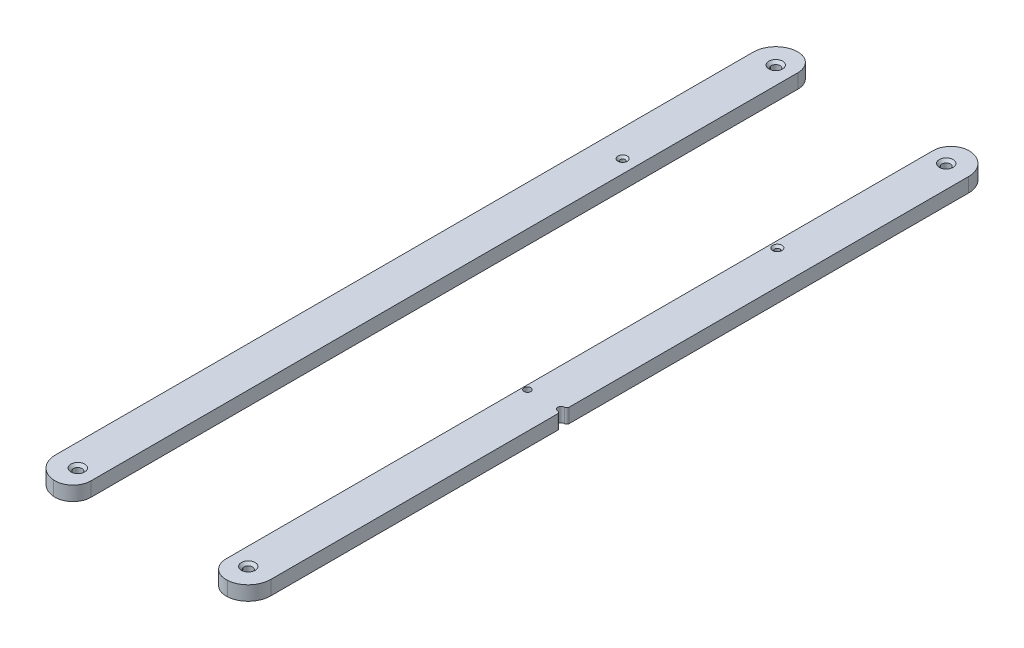
ISO-10303-21;
HEADER;
FILE_DESCRIPTION(('STEP AP214'),'2;1');
FILE_NAME('part.step','',(''),(''),'','','');
FILE_SCHEMA(('AUTOMOTIVE_DESIGN { 1 0 10303 214 1 1 1 1 }'));
ENDSEC;
DATA;
#1=APPLICATION_CONTEXT('core data for automotive mechanical design processes');
#2=APPLICATION_PROTOCOL_DEFINITION('international standard','automotive_design',2000,#1);
#3=PRODUCT_CONTEXT('',#1,'mechanical');
#4=PRODUCT('Part','Part','',(#3));
#5=PRODUCT_RELATED_PRODUCT_CATEGORY('part','',(#4));
#6=PRODUCT_DEFINITION_FORMATION('','',#4);
#7=PRODUCT_DEFINITION_CONTEXT('part definition',#1,'design');
#8=PRODUCT_DEFINITION('design','',#6,#7);
#9=PRODUCT_DEFINITION_SHAPE('','',#8);
#10=(LENGTH_UNIT() NAMED_UNIT(*) SI_UNIT(.MILLI.,.METRE.));
#11=(NAMED_UNIT(*) PLANE_ANGLE_UNIT() SI_UNIT($,.RADIAN.));
#12=(NAMED_UNIT(*) SI_UNIT($,.STERADIAN.) SOLID_ANGLE_UNIT());
#13=UNCERTAINTY_MEASURE_WITH_UNIT(LENGTH_MEASURE(1.E-05),#10,'distance_accuracy_value','');
#14=(GEOMETRIC_REPRESENTATION_CONTEXT(3) GLOBAL_UNCERTAINTY_ASSIGNED_CONTEXT((#13)) GLOBAL_UNIT_ASSIGNED_CONTEXT((#10,
#11,#12)) REPRESENTATION_CONTEXT('',''));
#15=CARTESIAN_POINT('',(0.,0.,0.));
#16=DIRECTION('',(0.,0.,1.));
#17=DIRECTION('',(1.,0.,0.));
#18=AXIS2_PLACEMENT_3D('',#15,#16,#17);
#19=CARTESIAN_POINT('',(0.,6.35,0.));
#20=DIRECTION('',(0.,-1.,0.));
#21=DIRECTION('',(0.,0.,-1.));
#22=AXIS2_PLACEMENT_3D('',#19,#20,#21);
#23=PLANE('',#22);
#24=CARTESIAN_POINT('',(37.85,6.35,155.));
#25=DIRECTION('',(0.,1.,0.));
#26=DIRECTION('',(0.,0.,1.));
#27=AXIS2_PLACEMENT_3D('',#24,#25,#26);
#28=CIRCLE('',#27,3.048);
#29=CARTESIAN_POINT('',(37.85,6.35,158.048));
#30=VERTEX_POINT('',#29);
#31=EDGE_CURVE('E257',#30,#30,#28,.T.);
#32=ORIENTED_EDGE('',*,*,#31,.F.);
#33=EDGE_LOOP('',(#32));
#34=FACE_BOUND('',#33,.T.);
#35=CARTESIAN_POINT('',(31.85,6.35,25.));
#36=DIRECTION('',(0.,1.,0.));
#37=DIRECTION('',(0.,0.,1.));
#38=AXIS2_PLACEMENT_3D('',#35,#36,#37);
#39=CIRCLE('',#38,1.5);
#40=CARTESIAN_POINT('',(31.85,6.35,26.5));
#41=VERTEX_POINT('',#40);
#42=EDGE_CURVE('E224',#41,#41,#39,.T.);
#43=ORIENTED_EDGE('',*,*,#42,.F.);
#44=EDGE_LOOP('',(#43));
#45=FACE_BOUND('',#44,.T.);
#46=CARTESIAN_POINT('',(32.85,6.35,-85.));
#47=DIRECTION('',(0.,1.,0.));
#48=DIRECTION('',(0.,0.,1.));
#49=AXIS2_PLACEMENT_3D('',#46,#47,#48);
#50=CIRCLE('',#49,2.0574);
#51=CARTESIAN_POINT('',(32.85,6.35,-82.9426));
#52=VERTEX_POINT('',#51);
#53=EDGE_CURVE('E275',#52,#52,#50,.T.);
#54=ORIENTED_EDGE('',*,*,#53,.F.);
#55=EDGE_LOOP('',(#54));
#56=FACE_BOUND('',#55,.T.);
#57=CARTESIAN_POINT('',(37.85,6.35,-155.));
#58=DIRECTION('',(0.,1.,0.));
#59=DIRECTION('',(0.,0.,1.));
#60=AXIS2_PLACEMENT_3D('',#57,#58,#59);
#61=CIRCLE('',#60,3.048);
#62=CARTESIAN_POINT('',(37.85,6.35,-151.952));
#63=VERTEX_POINT('',#62);
#64=EDGE_CURVE('E266',#63,#63,#61,.T.);
#65=ORIENTED_EDGE('',*,*,#64,.F.);
#66=EDGE_LOOP('',(#65));
#67=FACE_BOUND('',#66,.T.);
#68=DIRECTION('',(0.,0.,-1.));
#69=VECTOR('',#68,1.);
#70=CARTESIAN_POINT('',(30.,6.35,-165.));
#71=LINE('',#70,#69);
#72=CARTESIAN_POINT('',(30.,6.35,156.994367067518));
#73=VERTEX_POINT('',#72);
#74=CARTESIAN_POINT('',(30.,6.35,-156.994367067518));
#75=VERTEX_POINT('',#74);
#76=EDGE_CURVE('E255',#73,#75,#71,.T.);
#77=ORIENTED_EDGE('',*,*,#76,.F.);
#78=CARTESIAN_POINT('',(38.,6.35,156.994367067518));
#79=DIRECTION('',(0.,-1.,0.));
#80=DIRECTION('',(0.,0.,-1.));
#81=AXIS2_PLACEMENT_3D('',#78,#79,#80);
#82=CIRCLE('',#81,8.);
#83=CARTESIAN_POINT('',(38.6,6.35,164.97183533759));
#84=VERTEX_POINT('',#83);
#85=EDGE_CURVE('E92',#73,#84,#82,.F.);
#86=ORIENTED_EDGE('',*,*,#85,.T.);
#87=CARTESIAN_POINT('',(37.85,6.35,155.));
#88=DIRECTION('',(0.,-1.,0.));
#89=DIRECTION('',(0.,0.,-1.));
#90=AXIS2_PLACEMENT_3D('',#87,#88,#89);
#91=CIRCLE('',#90,10.);
#92=CARTESIAN_POINT('',(47.85,6.35,155.));
#93=VERTEX_POINT('',#92);
#94=EDGE_CURVE('E184',#84,#93,#91,.F.);
#95=ORIENTED_EDGE('',*,*,#94,.T.);
#96=DIRECTION('',(0.,0.,-1.));
#97=VECTOR('',#96,1.);
#98=CARTESIAN_POINT('',(47.85,6.35,165.));
#99=LINE('',#98,#97);
#100=CARTESIAN_POINT('',(47.85,6.35,27.5));
#101=VERTEX_POINT('',#100);
#102=EDGE_CURVE('E172',#93,#101,#99,.T.);
#103=ORIENTED_EDGE('',*,*,#102,.T.);
#104=CARTESIAN_POINT('',(46.85,6.35,27.5));
#105=DIRECTION('',(0.,-1.,0.));
#106=DIRECTION('',(0.,0.,-1.));
#107=AXIS2_PLACEMENT_3D('',#104,#105,#106);
#108=CIRCLE('',#107,1.);
#109=CARTESIAN_POINT('',(46.85,6.35,26.5));
#110=VERTEX_POINT('',#109);
#111=EDGE_CURVE('E162',#101,#110,#108,.F.);
#112=ORIENTED_EDGE('',*,*,#111,.T.);
#113=CARTESIAN_POINT('',(46.85,6.35,25.));
#114=DIRECTION('',(0.,1.,0.));
#115=DIRECTION('',(0.,0.,1.));
#116=AXIS2_PLACEMENT_3D('',#113,#114,#115);
#117=CIRCLE('',#116,1.49999999999999);
#118=CARTESIAN_POINT('',(46.85,6.35,23.5));
#119=VERTEX_POINT('',#118);
#120=EDGE_CURVE('E199',#119,#110,#117,.T.);
#121=ORIENTED_EDGE('',*,*,#120,.F.);
#122=CARTESIAN_POINT('',(46.85,6.35,22.5));
#123=DIRECTION('',(0.,-1.,0.));
#124=DIRECTION('',(0.,0.,-1.));
#125=AXIS2_PLACEMENT_3D('',#122,#123,#124);
#126=CIRCLE('',#125,1.);
#127=CARTESIAN_POINT('',(47.85,6.35,22.5));
#128=VERTEX_POINT('',#127);
#129=EDGE_CURVE('E171',#119,#128,#126,.F.);
#130=ORIENTED_EDGE('',*,*,#129,.T.);
#131=CARTESIAN_POINT('',(47.85,6.35,-155.));
#132=VERTEX_POINT('',#131);
#133=EDGE_CURVE('E186',#128,#132,#99,.T.);
#134=ORIENTED_EDGE('',*,*,#133,.T.);
#135=CARTESIAN_POINT('',(37.85,6.35,-155.));
#136=DIRECTION('',(0.,-1.,0.));
#137=DIRECTION('',(0.,0.,-1.));
#138=AXIS2_PLACEMENT_3D('',#135,#136,#137);
#139=CIRCLE('',#138,10.);
#140=CARTESIAN_POINT('',(38.6,6.35,-164.97183533759));
#141=VERTEX_POINT('',#140);
#142=EDGE_CURVE('E190',#132,#141,#139,.F.);
#143=ORIENTED_EDGE('',*,*,#142,.T.);
#144=CARTESIAN_POINT('',(38.,6.35,-156.994367067518));
#145=DIRECTION('',(0.,-1.,0.));
#146=DIRECTION('',(0.,0.,-1.));
#147=AXIS2_PLACEMENT_3D('',#144,#145,#146);
#148=CIRCLE('',#147,8.);
#149=EDGE_CURVE('E104',#141,#75,#148,.F.);
#150=ORIENTED_EDGE('',*,*,#149,.T.);
#151=EDGE_LOOP('',(#77,#86,#95,#103,#112,#121,#130,#134,#143,#150));
#152=FACE_BOUND('',#151,.T.);
#153=ADVANCED_FACE('F84',(#34,#45,#56,#67,#152),#23,.F.);
#154=CARTESIAN_POINT('',(0.,0.,0.));
#155=DIRECTION('',(0.,-1.,0.));
#156=DIRECTION('',(0.,0.,-1.));
#157=AXIS2_PLACEMENT_3D('',#154,#155,#156);
#158=PLANE('',#157);
#159=CARTESIAN_POINT('',(31.85,0.,25.));
#160=DIRECTION('',(0.,-1.,0.));
#161=DIRECTION('',(0.,0.,-1.));
#162=AXIS2_PLACEMENT_3D('',#159,#160,#161);
#163=CIRCLE('',#162,1.5);
#164=CARTESIAN_POINT('',(31.85,0.,23.5));
#165=VERTEX_POINT('',#164);
#166=EDGE_CURVE('E202',#165,#165,#163,.T.);
#167=ORIENTED_EDGE('',*,*,#166,.F.);
#168=EDGE_LOOP('',(#167));
#169=FACE_BOUND('',#168,.T.);
#170=CARTESIAN_POINT('',(32.85,0.,-85.));
#171=DIRECTION('',(0.,1.,0.));
#172=DIRECTION('',(0.,0.,1.));
#173=AXIS2_PLACEMENT_3D('',#170,#171,#172);
#174=CIRCLE('',#173,1.1303);
#175=CARTESIAN_POINT('',(32.85,0.,-83.8697));
#176=VERTEX_POINT('',#175);
#177=EDGE_CURVE('E192',#176,#176,#174,.T.);
#178=ORIENTED_EDGE('',*,*,#177,.T.);
#179=EDGE_LOOP('',(#178));
#180=FACE_BOUND('',#179,.T.);
#181=CARTESIAN_POINT('',(37.85,0.,-155.));
#182=DIRECTION('',(0.,1.,0.));
#183=DIRECTION('',(0.,0.,1.));
#184=AXIS2_PLACEMENT_3D('',#181,#182,#183);
#185=CIRCLE('',#184,1.89864999999999);
#186=CARTESIAN_POINT('',(37.85,0.,-153.10135));
#187=VERTEX_POINT('',#186);
#188=EDGE_CURVE('E269',#187,#187,#185,.T.);
#189=ORIENTED_EDGE('',*,*,#188,.T.);
#190=EDGE_LOOP('',(#189));
#191=FACE_BOUND('',#190,.T.);
#192=CARTESIAN_POINT('',(37.85,0.,155.));
#193=DIRECTION('',(0.,1.,0.));
#194=DIRECTION('',(0.,0.,1.));
#195=AXIS2_PLACEMENT_3D('',#192,#193,#194);
#196=CIRCLE('',#195,1.89864999999999);
#197=CARTESIAN_POINT('',(37.85,0.,156.89865));
#198=VERTEX_POINT('',#197);
#199=EDGE_CURVE('E260',#198,#198,#196,.T.);
#200=ORIENTED_EDGE('',*,*,#199,.T.);
#201=EDGE_LOOP('',(#200));
#202=FACE_BOUND('',#201,.T.);
#203=CARTESIAN_POINT('',(37.85,0.,155.));
#204=DIRECTION('',(0.,-1.,0.));
#205=DIRECTION('',(0.,0.,-1.));
#206=AXIS2_PLACEMENT_3D('',#203,#204,#205);
#207=CIRCLE('',#206,10.);
#208=CARTESIAN_POINT('',(47.85,0.,155.));
#209=VERTEX_POINT('',#208);
#210=CARTESIAN_POINT('',(38.6,0.,164.97183533759));
#211=VERTEX_POINT('',#210);
#212=EDGE_CURVE('E208',#209,#211,#207,.T.);
#213=ORIENTED_EDGE('',*,*,#212,.T.);
#214=CARTESIAN_POINT('',(38.,0.,156.994367067518));
#215=DIRECTION('',(0.,-1.,0.));
#216=DIRECTION('',(0.,0.,-1.));
#217=AXIS2_PLACEMENT_3D('',#214,#215,#216);
#218=CIRCLE('',#217,8.);
#219=CARTESIAN_POINT('',(30.,0.,156.994367067518));
#220=VERTEX_POINT('',#219);
#221=EDGE_CURVE('E248',#211,#220,#218,.T.);
#222=ORIENTED_EDGE('',*,*,#221,.T.);
#223=DIRECTION('',(0.,0.,-1.));
#224=VECTOR('',#223,1.);
#225=CARTESIAN_POINT('',(30.,0.,-165.));
#226=LINE('',#225,#224);
#227=CARTESIAN_POINT('',(30.,0.,-156.994367067518));
#228=VERTEX_POINT('',#227);
#229=EDGE_CURVE('E220',#220,#228,#226,.T.);
#230=ORIENTED_EDGE('',*,*,#229,.T.);
#231=CARTESIAN_POINT('',(38.,0.,-156.994367067518));
#232=DIRECTION('',(0.,-1.,0.));
#233=DIRECTION('',(0.,0.,-1.));
#234=AXIS2_PLACEMENT_3D('',#231,#232,#233);
#235=CIRCLE('',#234,8.);
#236=CARTESIAN_POINT('',(38.6,0.,-164.97183533759));
#237=VERTEX_POINT('',#236);
#238=EDGE_CURVE('E250',#228,#237,#235,.T.);
#239=ORIENTED_EDGE('',*,*,#238,.T.);
#240=CARTESIAN_POINT('',(37.85,0.,-155.));
#241=DIRECTION('',(0.,-1.,0.));
#242=DIRECTION('',(0.,0.,-1.));
#243=AXIS2_PLACEMENT_3D('',#240,#241,#242);
#244=CIRCLE('',#243,10.);
#245=CARTESIAN_POINT('',(47.85,0.,-155.));
#246=VERTEX_POINT('',#245);
#247=EDGE_CURVE('E206',#237,#246,#244,.T.);
#248=ORIENTED_EDGE('',*,*,#247,.T.);
#249=DIRECTION('',(0.,0.,-1.));
#250=VECTOR('',#249,1.);
#251=CARTESIAN_POINT('',(47.85,0.,165.));
#252=LINE('',#251,#250);
#253=CARTESIAN_POINT('',(47.85,0.,22.5));
#254=VERTEX_POINT('',#253);
#255=EDGE_CURVE('E212',#254,#246,#252,.T.);
#256=ORIENTED_EDGE('',*,*,#255,.F.);
#257=CARTESIAN_POINT('',(46.85,0.,22.5));
#258=DIRECTION('',(0.,-1.,0.));
#259=DIRECTION('',(0.,0.,-1.));
#260=AXIS2_PLACEMENT_3D('',#257,#258,#259);
#261=CIRCLE('',#260,1.);
#262=CARTESIAN_POINT('',(46.85,0.,23.5));
#263=VERTEX_POINT('',#262);
#264=EDGE_CURVE('E203',#254,#263,#261,.T.);
#265=ORIENTED_EDGE('',*,*,#264,.T.);
#266=CARTESIAN_POINT('',(46.85,0.,25.));
#267=DIRECTION('',(0.,-1.,0.));
#268=DIRECTION('',(0.,0.,-1.));
#269=AXIS2_PLACEMENT_3D('',#266,#267,#268);
#270=CIRCLE('',#269,1.49999999999999);
#271=CARTESIAN_POINT('',(46.85,0.,26.5));
#272=VERTEX_POINT('',#271);
#273=EDGE_CURVE('E200',#272,#263,#270,.T.);
#274=ORIENTED_EDGE('',*,*,#273,.F.);
#275=CARTESIAN_POINT('',(46.85,0.,27.5));
#276=DIRECTION('',(0.,-1.,0.));
#277=DIRECTION('',(0.,0.,-1.));
#278=AXIS2_PLACEMENT_3D('',#275,#276,#277);
#279=CIRCLE('',#278,1.);
#280=CARTESIAN_POINT('',(47.85,0.,27.5));
#281=VERTEX_POINT('',#280);
#282=EDGE_CURVE('E205',#272,#281,#279,.T.);
#283=ORIENTED_EDGE('',*,*,#282,.T.);
#284=EDGE_CURVE('E180',#209,#281,#252,.T.);
#285=ORIENTED_EDGE('',*,*,#284,.F.);
#286=EDGE_LOOP('',(#213,#222,#230,#239,#248,#256,#265,#274,#283,#285));
#287=FACE_BOUND('',#286,.T.);
#288=ADVANCED_FACE('F284',(#169,#180,#191,#202,#287),#158,.T.);
#289=CARTESIAN_POINT('',(46.85,-3.65,25.));
#290=DIRECTION('',(0.,1.,0.));
#291=DIRECTION('',(0.,0.,1.));
#292=AXIS2_PLACEMENT_3D('',#289,#290,#291);
#293=CYLINDRICAL_SURFACE('',#292,1.49999999999999);
#294=ORIENTED_EDGE('',*,*,#273,.T.);
#295=DIRECTION('',(0.,1.,0.));
#296=VECTOR('',#295,1.);
#297=CARTESIAN_POINT('',(46.85,-3.65,23.5));
#298=LINE('',#297,#296);
#299=EDGE_CURVE('E197',#263,#119,#298,.T.);
#300=ORIENTED_EDGE('',*,*,#299,.T.);
#301=ORIENTED_EDGE('',*,*,#120,.T.);
#302=DIRECTION('',(0.,1.,0.));
#303=VECTOR('',#302,1.);
#304=CARTESIAN_POINT('',(46.85,-3.65,26.5));
#305=LINE('',#304,#303);
#306=EDGE_CURVE('E167',#110,#272,#305,.F.);
#307=ORIENTED_EDGE('',*,*,#306,.T.);
#308=EDGE_LOOP('',(#294,#300,#301,#307));
#309=FACE_BOUND('',#308,.T.);
#310=ADVANCED_FACE('F333',(#309),#293,.F.);
#311=CARTESIAN_POINT('',(31.85,-3.65,25.));
#312=DIRECTION('',(0.,1.,0.));
#313=DIRECTION('',(0.,0.,1.));
#314=AXIS2_PLACEMENT_3D('',#311,#312,#313);
#315=CYLINDRICAL_SURFACE('',#314,1.5);
#316=ORIENTED_EDGE('',*,*,#166,.T.);
#317=EDGE_LOOP('',(#316));
#318=FACE_BOUND('',#317,.T.);
#319=ORIENTED_EDGE('',*,*,#42,.T.);
#320=EDGE_LOOP('',(#319));
#321=FACE_BOUND('',#320,.T.);
#322=ADVANCED_FACE('F362',(#318,#321),#315,.F.);
#323=CARTESIAN_POINT('',(47.85,0.,165.));
#324=DIRECTION('',(1.,0.,0.));
#325=DIRECTION('',(0.,0.,-1.));
#326=AXIS2_PLACEMENT_3D('',#323,#324,#325);
#327=PLANE('',#326);
#328=ORIENTED_EDGE('',*,*,#284,.T.);
#329=DIRECTION('',(0.,-1.,0.));
#330=VECTOR('',#329,1.);
#331=CARTESIAN_POINT('',(47.85,6.35,27.5));
#332=LINE('',#331,#330);
#333=EDGE_CURVE('E166',#281,#101,#332,.F.);
#334=ORIENTED_EDGE('',*,*,#333,.T.);
#335=ORIENTED_EDGE('',*,*,#102,.F.);
#336=DIRECTION('',(0.,1.,0.));
#337=VECTOR('',#336,1.);
#338=CARTESIAN_POINT('',(47.85,0.,155.));
#339=LINE('',#338,#337);
#340=EDGE_CURVE('E181',#93,#209,#339,.F.);
#341=ORIENTED_EDGE('',*,*,#340,.T.);
#342=EDGE_LOOP('',(#328,#334,#335,#341));
#343=FACE_BOUND('',#342,.T.);
#344=ADVANCED_FACE('F177',(#343),#327,.T.);
#345=ORIENTED_EDGE('',*,*,#133,.F.);
#346=DIRECTION('',(0.,-1.,0.));
#347=VECTOR('',#346,1.);
#348=CARTESIAN_POINT('',(47.85,0.,22.5));
#349=LINE('',#348,#347);
#350=EDGE_CURVE('E209',#128,#254,#349,.T.);
#351=ORIENTED_EDGE('',*,*,#350,.T.);
#352=ORIENTED_EDGE('',*,*,#255,.T.);
#353=DIRECTION('',(0.,1.,0.));
#354=VECTOR('',#353,1.);
#355=CARTESIAN_POINT('',(47.85,6.35,-155.));
#356=LINE('',#355,#354);
#357=EDGE_CURVE('E213',#246,#132,#356,.T.);
#358=ORIENTED_EDGE('',*,*,#357,.T.);
#359=EDGE_LOOP('',(#345,#351,#352,#358));
#360=FACE_BOUND('',#359,.T.);
#361=ADVANCED_FACE('F235',(#360),#327,.T.);
#362=CARTESIAN_POINT('',(32.85,6.35,-85.));
#363=DIRECTION('',(0.,1.,0.));
#364=DIRECTION('',(0.,0.,1.));
#365=AXIS2_PLACEMENT_3D('',#362,#363,#364);
#366=CYLINDRICAL_SURFACE('',#365,1.1303);
#367=ORIENTED_EDGE('',*,*,#177,.F.);
#368=EDGE_LOOP('',(#367));
#369=FACE_BOUND('',#368,.T.);
#370=CARTESIAN_POINT('',(32.85,5.4229,-85.));
#371=DIRECTION('',(0.,1.,0.));
#372=DIRECTION('',(0.,0.,1.));
#373=AXIS2_PLACEMENT_3D('',#370,#371,#372);
#374=CIRCLE('',#373,1.1303);
#375=CARTESIAN_POINT('',(32.85,5.4229,-83.8697));
#376=VERTEX_POINT('',#375);
#377=EDGE_CURVE('E216',#376,#376,#374,.T.);
#378=ORIENTED_EDGE('',*,*,#377,.T.);
#379=EDGE_LOOP('',(#378));
#380=FACE_BOUND('',#379,.T.);
#381=ADVANCED_FACE('F287',(#369,#380),#366,.F.);
#382=CARTESIAN_POINT('',(32.85,6.35,-85.));
#383=DIRECTION('',(0.,1.,0.));
#384=DIRECTION('',(0.,0.,1.));
#385=AXIS2_PLACEMENT_3D('',#382,#383,#384);
#386=CONICAL_SURFACE('',#385,2.0574,0.785398163397448);
#387=ORIENTED_EDGE('',*,*,#377,.F.);
#388=EDGE_LOOP('',(#387));
#389=FACE_BOUND('',#388,.T.);
#390=ORIENTED_EDGE('',*,*,#53,.T.);
#391=EDGE_LOOP('',(#390));
#392=FACE_BOUND('',#391,.T.);
#393=ADVANCED_FACE('F290',(#389,#392),#386,.F.);
#394=CARTESIAN_POINT('',(37.85,6.35,155.));
#395=DIRECTION('',(0.,-1.,0.));
#396=DIRECTION('',(0.,0.,-1.));
#397=AXIS2_PLACEMENT_3D('',#394,#395,#396);
#398=CYLINDRICAL_SURFACE('',#397,10.);
#399=ORIENTED_EDGE('',*,*,#94,.F.);
#400=DIRECTION('',(0.,-1.,0.));
#401=VECTOR('',#400,1.);
#402=CARTESIAN_POINT('',(38.6,6.35,164.97183533759));
#403=LINE('',#402,#401);
#404=EDGE_CURVE('E252',#84,#211,#403,.T.);
#405=ORIENTED_EDGE('',*,*,#404,.T.);
#406=ORIENTED_EDGE('',*,*,#212,.F.);
#407=ORIENTED_EDGE('',*,*,#340,.F.);
#408=EDGE_LOOP('',(#399,#405,#406,#407));
#409=FACE_BOUND('',#408,.T.);
#410=ADVANCED_FACE('F296',(#409),#398,.T.);
#411=CARTESIAN_POINT('',(37.85,0.,-155.));
#412=DIRECTION('',(0.,-1.,0.));
#413=DIRECTION('',(0.,0.,-1.));
#414=AXIS2_PLACEMENT_3D('',#411,#412,#413);
#415=CYLINDRICAL_SURFACE('',#414,10.);
#416=ORIENTED_EDGE('',*,*,#247,.F.);
#417=DIRECTION('',(0.,-1.,0.));
#418=VECTOR('',#417,1.);
#419=CARTESIAN_POINT('',(38.6,0.,-164.97183533759));
#420=LINE('',#419,#418);
#421=EDGE_CURVE('E14',#237,#141,#420,.F.);
#422=ORIENTED_EDGE('',*,*,#421,.T.);
#423=ORIENTED_EDGE('',*,*,#142,.F.);
#424=ORIENTED_EDGE('',*,*,#357,.F.);
#425=EDGE_LOOP('',(#416,#422,#423,#424));
#426=FACE_BOUND('',#425,.T.);
#427=ADVANCED_FACE('F238',(#426),#415,.T.);
#428=CARTESIAN_POINT('',(37.85,6.35,-155.));
#429=DIRECTION('',(0.,1.,0.));
#430=DIRECTION('',(0.,0.,1.));
#431=AXIS2_PLACEMENT_3D('',#428,#429,#430);
#432=CYLINDRICAL_SURFACE('',#431,1.89864999999999);
#433=ORIENTED_EDGE('',*,*,#188,.F.);
#434=EDGE_LOOP('',(#433));
#435=FACE_BOUND('',#434,.T.);
#436=CARTESIAN_POINT('',(37.85,5.20065,-155.));
#437=DIRECTION('',(0.,1.,0.));
#438=DIRECTION('',(0.,0.,1.));
#439=AXIS2_PLACEMENT_3D('',#436,#437,#438);
#440=CIRCLE('',#439,1.89865);
#441=CARTESIAN_POINT('',(37.85,5.20065,-153.10135));
#442=VERTEX_POINT('',#441);
#443=EDGE_CURVE('E272',#442,#442,#440,.T.);
#444=ORIENTED_EDGE('',*,*,#443,.T.);
#445=EDGE_LOOP('',(#444));
#446=FACE_BOUND('',#445,.T.);
#447=ADVANCED_FACE('F309',(#435,#446),#432,.F.);
#448=CARTESIAN_POINT('',(37.85,6.35,-155.));
#449=DIRECTION('',(0.,1.,0.));
#450=DIRECTION('',(0.,0.,1.));
#451=AXIS2_PLACEMENT_3D('',#448,#449,#450);
#452=CONICAL_SURFACE('',#451,3.048,0.785398163397448);
#453=ORIENTED_EDGE('',*,*,#443,.F.);
#454=EDGE_LOOP('',(#453));
#455=FACE_BOUND('',#454,.T.);
#456=ORIENTED_EDGE('',*,*,#64,.T.);
#457=EDGE_LOOP('',(#456));
#458=FACE_BOUND('',#457,.T.);
#459=ADVANCED_FACE('F306',(#455,#458),#452,.F.);
#460=CARTESIAN_POINT('',(37.85,6.35,155.));
#461=DIRECTION('',(0.,1.,0.));
#462=DIRECTION('',(0.,0.,1.));
#463=AXIS2_PLACEMENT_3D('',#460,#461,#462);
#464=CYLINDRICAL_SURFACE('',#463,1.89864999999999);
#465=ORIENTED_EDGE('',*,*,#199,.F.);
#466=EDGE_LOOP('',(#465));
#467=FACE_BOUND('',#466,.T.);
#468=CARTESIAN_POINT('',(37.85,5.20065,155.));
#469=DIRECTION('',(0.,1.,0.));
#470=DIRECTION('',(0.,0.,1.));
#471=AXIS2_PLACEMENT_3D('',#468,#469,#470);
#472=CIRCLE('',#471,1.89865);
#473=CARTESIAN_POINT('',(37.85,5.20065,156.89865));
#474=VERTEX_POINT('',#473);
#475=EDGE_CURVE('E263',#474,#474,#472,.T.);
#476=ORIENTED_EDGE('',*,*,#475,.T.);
#477=EDGE_LOOP('',(#476));
#478=FACE_BOUND('',#477,.T.);
#479=ADVANCED_FACE('F308',(#467,#478),#464,.F.);
#480=CARTESIAN_POINT('',(37.85,6.35,155.));
#481=DIRECTION('',(0.,1.,0.));
#482=DIRECTION('',(0.,0.,1.));
#483=AXIS2_PLACEMENT_3D('',#480,#481,#482);
#484=CONICAL_SURFACE('',#483,3.048,0.785398163397448);
#485=ORIENTED_EDGE('',*,*,#475,.F.);
#486=EDGE_LOOP('',(#485));
#487=FACE_BOUND('',#486,.T.);
#488=ORIENTED_EDGE('',*,*,#31,.T.);
#489=EDGE_LOOP('',(#488));
#490=FACE_BOUND('',#489,.T.);
#491=ADVANCED_FACE('F316',(#487,#490),#484,.F.);
#492=CARTESIAN_POINT('',(46.85,-3.65,22.5));
#493=DIRECTION('',(0.,1.,0.));
#494=DIRECTION('',(0.,0.,1.));
#495=AXIS2_PLACEMENT_3D('',#492,#493,#494);
#496=CYLINDRICAL_SURFACE('',#495,1.);
#497=ORIENTED_EDGE('',*,*,#129,.F.);
#498=ORIENTED_EDGE('',*,*,#299,.F.);
#499=ORIENTED_EDGE('',*,*,#264,.F.);
#500=ORIENTED_EDGE('',*,*,#350,.F.);
#501=EDGE_LOOP('',(#497,#498,#499,#500));
#502=FACE_BOUND('',#501,.T.);
#503=ADVANCED_FACE('F325',(#502),#496,.T.);
#504=CARTESIAN_POINT('',(46.85,-3.65,27.5));
#505=DIRECTION('',(0.,1.,0.));
#506=DIRECTION('',(0.,0.,1.));
#507=AXIS2_PLACEMENT_3D('',#504,#505,#506);
#508=CYLINDRICAL_SURFACE('',#507,1.);
#509=ORIENTED_EDGE('',*,*,#282,.F.);
#510=ORIENTED_EDGE('',*,*,#306,.F.);
#511=ORIENTED_EDGE('',*,*,#111,.F.);
#512=ORIENTED_EDGE('',*,*,#333,.F.);
#513=EDGE_LOOP('',(#509,#510,#511,#512));
#514=FACE_BOUND('',#513,.T.);
#515=ADVANCED_FACE('F165',(#514),#508,.T.);
#516=CARTESIAN_POINT('',(30.,6.35,-165.));
#517=DIRECTION('',(-1.,0.,0.));
#518=DIRECTION('',(0.,0.,1.));
#519=AXIS2_PLACEMENT_3D('',#516,#517,#518);
#520=PLANE('',#519);
#521=ORIENTED_EDGE('',*,*,#229,.F.);
#522=DIRECTION('',(0.,-1.,0.));
#523=VECTOR('',#522,1.);
#524=CARTESIAN_POINT('',(30.,6.35,156.994367067518));
#525=LINE('',#524,#523);
#526=EDGE_CURVE('E243',#220,#73,#525,.F.);
#527=ORIENTED_EDGE('',*,*,#526,.T.);
#528=ORIENTED_EDGE('',*,*,#76,.T.);
#529=DIRECTION('',(0.,-1.,0.));
#530=VECTOR('',#529,1.);
#531=CARTESIAN_POINT('',(30.,6.35,-156.994367067518));
#532=LINE('',#531,#530);
#533=EDGE_CURVE('E242',#75,#228,#532,.T.);
#534=ORIENTED_EDGE('',*,*,#533,.T.);
#535=EDGE_LOOP('',(#521,#527,#528,#534));
#536=FACE_BOUND('',#535,.T.);
#537=ADVANCED_FACE('F327',(#536),#520,.T.);
#538=CARTESIAN_POINT('',(38.,6.35,156.994367067518));
#539=DIRECTION('',(0.,-1.,0.));
#540=DIRECTION('',(0.,0.,-1.));
#541=AXIS2_PLACEMENT_3D('',#538,#539,#540);
#542=CYLINDRICAL_SURFACE('',#541,8.);
#543=ORIENTED_EDGE('',*,*,#85,.F.);
#544=ORIENTED_EDGE('',*,*,#526,.F.);
#545=ORIENTED_EDGE('',*,*,#221,.F.);
#546=ORIENTED_EDGE('',*,*,#404,.F.);
#547=EDGE_LOOP('',(#543,#544,#545,#546));
#548=FACE_BOUND('',#547,.T.);
#549=ADVANCED_FACE('F330',(#548),#542,.T.);
#550=CARTESIAN_POINT('',(38.,0.,-156.994367067518));
#551=DIRECTION('',(0.,-1.,0.));
#552=DIRECTION('',(0.,0.,-1.));
#553=AXIS2_PLACEMENT_3D('',#550,#551,#552);
#554=CYLINDRICAL_SURFACE('',#553,8.);
#555=ORIENTED_EDGE('',*,*,#149,.F.);
#556=ORIENTED_EDGE('',*,*,#421,.F.);
#557=ORIENTED_EDGE('',*,*,#238,.F.);
#558=ORIENTED_EDGE('',*,*,#533,.F.);
#559=EDGE_LOOP('',(#555,#556,#557,#558));
#560=FACE_BOUND('',#559,.T.);
#561=ADVANCED_FACE('F86',(#560),#554,.T.);
#562=CLOSED_SHELL('',(#153,#288,#310,#322,#344,#361,#381,#393,#410,#427,#447,#459,#479,#491,
#503,#515,#537,#549,#561));
#563=MANIFOLD_SOLID_BREP('B2',#562);
#564=CARTESIAN_POINT('',(-37.85,6.35,-155.));
#565=DIRECTION('',(0.,1.,0.));
#566=DIRECTION('',(0.,0.,1.));
#567=AXIS2_PLACEMENT_3D('',#564,#565,#566);
#568=CONICAL_SURFACE('',#567,3.048,0.785398163397448);
#569=CARTESIAN_POINT('',(-37.85,5.20065,-155.));
#570=DIRECTION('',(0.,1.,0.));
#571=DIRECTION('',(0.,0.,1.));
#572=AXIS2_PLACEMENT_3D('',#569,#570,#571);
#573=CIRCLE('',#572,1.89865);
#574=CARTESIAN_POINT('',(-37.85,5.20065,-153.10135));
#575=VERTEX_POINT('',#574);
#576=EDGE_CURVE('E631',#575,#575,#573,.T.);
#577=ORIENTED_EDGE('',*,*,#576,.F.);
#578=EDGE_LOOP('',(#577));
#579=FACE_BOUND('',#578,.T.);
#580=CARTESIAN_POINT('',(-37.85,6.35,-155.));
#581=DIRECTION('',(0.,1.,0.));
#582=DIRECTION('',(0.,0.,1.));
#583=AXIS2_PLACEMENT_3D('',#580,#581,#582);
#584=CIRCLE('',#583,3.048);
#585=CARTESIAN_POINT('',(-37.85,6.35,-151.952));
#586=VERTEX_POINT('',#585);
#587=EDGE_CURVE('E634',#586,#586,#584,.T.);
#588=ORIENTED_EDGE('',*,*,#587,.T.);
#589=EDGE_LOOP('',(#588));
#590=FACE_BOUND('',#589,.T.);
#591=ADVANCED_FACE('F508',(#579,#590),#568,.F.);
#592=CARTESIAN_POINT('',(-35.85,6.35,-85.));
#593=DIRECTION('',(0.,1.,0.));
#594=DIRECTION('',(0.,0.,1.));
#595=AXIS2_PLACEMENT_3D('',#592,#593,#594);
#596=CONICAL_SURFACE('',#595,2.0574,0.785398163397448);
#597=CARTESIAN_POINT('',(-35.85,5.4229,-85.));
#598=DIRECTION('',(0.,1.,0.));
#599=DIRECTION('',(0.,0.,1.));
#600=AXIS2_PLACEMENT_3D('',#597,#598,#599);
#601=CIRCLE('',#600,1.1303);
#602=CARTESIAN_POINT('',(-35.85,5.4229,-83.8697));
#603=VERTEX_POINT('',#602);
#604=EDGE_CURVE('E622',#603,#603,#601,.T.);
#605=ORIENTED_EDGE('',*,*,#604,.F.);
#606=EDGE_LOOP('',(#605));
#607=FACE_BOUND('',#606,.T.);
#608=CARTESIAN_POINT('',(-35.85,6.35,-85.));
#609=DIRECTION('',(0.,1.,0.));
#610=DIRECTION('',(0.,0.,1.));
#611=AXIS2_PLACEMENT_3D('',#608,#609,#610);
#612=CIRCLE('',#611,2.0574);
#613=CARTESIAN_POINT('',(-35.85,6.35,-82.9426));
#614=VERTEX_POINT('',#613);
#615=EDGE_CURVE('E625',#614,#614,#612,.T.);
#616=ORIENTED_EDGE('',*,*,#615,.T.);
#617=EDGE_LOOP('',(#616));
#618=FACE_BOUND('',#617,.T.);
#619=ADVANCED_FACE('F652',(#607,#618),#596,.F.);
#620=CARTESIAN_POINT('',(-37.85,6.35,155.));
#621=DIRECTION('',(0.,1.,0.));
#622=DIRECTION('',(0.,0.,1.));
#623=AXIS2_PLACEMENT_3D('',#620,#621,#622);
#624=CONICAL_SURFACE('',#623,3.048,0.785398163397448);
#625=CARTESIAN_POINT('',(-37.85,5.20065,155.));
#626=DIRECTION('',(0.,1.,0.));
#627=DIRECTION('',(0.,0.,1.));
#628=AXIS2_PLACEMENT_3D('',#625,#626,#627);
#629=CIRCLE('',#628,1.89865);
#630=CARTESIAN_POINT('',(-37.85,5.20065,156.89865));
#631=VERTEX_POINT('',#630);
#632=EDGE_CURVE('E640',#631,#631,#629,.T.);
#633=ORIENTED_EDGE('',*,*,#632,.F.);
#634=EDGE_LOOP('',(#633));
#635=FACE_BOUND('',#634,.T.);
#636=CARTESIAN_POINT('',(-37.85,6.35,155.));
#637=DIRECTION('',(0.,1.,0.));
#638=DIRECTION('',(0.,0.,1.));
#639=AXIS2_PLACEMENT_3D('',#636,#637,#638);
#640=CIRCLE('',#639,3.048);
#641=CARTESIAN_POINT('',(-37.85,6.35,158.048));
#642=VERTEX_POINT('',#641);
#643=EDGE_CURVE('E612',#642,#642,#640,.T.);
#644=ORIENTED_EDGE('',*,*,#643,.T.);
#645=EDGE_LOOP('',(#644));
#646=FACE_BOUND('',#645,.T.);
#647=ADVANCED_FACE('F658',(#635,#646),#624,.F.);
#648=CARTESIAN_POINT('',(-47.85,0.,165.));
#649=DIRECTION('',(-1.,0.,0.));
#650=DIRECTION('',(0.,0.,1.));
#651=AXIS2_PLACEMENT_3D('',#648,#649,#650);
#652=PLANE('',#651);
#653=DIRECTION('',(0.,0.,1.));
#654=VECTOR('',#653,1.);
#655=CARTESIAN_POINT('',(-47.85,6.35,165.));
#656=LINE('',#655,#654);
#657=CARTESIAN_POINT('',(-47.85,6.35,-155.));
#658=VERTEX_POINT('',#657);
#659=CARTESIAN_POINT('',(-47.85,6.35,155.));
#660=VERTEX_POINT('',#659);
#661=EDGE_CURVE('E563',#658,#660,#656,.T.);
#662=ORIENTED_EDGE('',*,*,#661,.F.);
#663=DIRECTION('',(0.,1.,0.));
#664=VECTOR('',#663,1.);
#665=CARTESIAN_POINT('',(-47.85,0.,-155.));
#666=LINE('',#665,#664);
#667=CARTESIAN_POINT('',(-47.85,0.,-155.));
#668=VERTEX_POINT('',#667);
#669=EDGE_CURVE('E576',#658,#668,#666,.F.);
#670=ORIENTED_EDGE('',*,*,#669,.T.);
#671=DIRECTION('',(0.,0.,1.));
#672=VECTOR('',#671,1.);
#673=CARTESIAN_POINT('',(-47.85,0.,165.));
#674=LINE('',#673,#672);
#675=CARTESIAN_POINT('',(-47.85,0.,155.));
#676=VERTEX_POINT('',#675);
#677=EDGE_CURVE('E579',#668,#676,#674,.T.);
#678=ORIENTED_EDGE('',*,*,#677,.T.);
#679=DIRECTION('',(0.,1.,0.));
#680=VECTOR('',#679,1.);
#681=CARTESIAN_POINT('',(-47.85,6.35,155.));
#682=LINE('',#681,#680);
#683=EDGE_CURVE('E569',#676,#660,#682,.T.);
#684=ORIENTED_EDGE('',*,*,#683,.T.);
#685=EDGE_LOOP('',(#662,#670,#678,#684));
#686=FACE_BOUND('',#685,.T.);
#687=ADVANCED_FACE('F574',(#686),#652,.T.);
#688=CARTESIAN_POINT('',(-37.85,6.35,-155.));
#689=DIRECTION('',(0.,1.,0.));
#690=DIRECTION('',(0.,0.,1.));
#691=AXIS2_PLACEMENT_3D('',#688,#689,#690);
#692=CYLINDRICAL_SURFACE('',#691,1.89864999999999);
#693=CARTESIAN_POINT('',(-37.85,0.,-155.));
#694=DIRECTION('',(0.,1.,0.));
#695=DIRECTION('',(0.,0.,1.));
#696=AXIS2_PLACEMENT_3D('',#693,#694,#695);
#697=CIRCLE('',#696,1.89864999999999);
#698=CARTESIAN_POINT('',(-37.85,0.,-153.10135));
#699=VERTEX_POINT('',#698);
#700=EDGE_CURVE('E628',#699,#699,#697,.T.);
#701=ORIENTED_EDGE('',*,*,#700,.F.);
#702=EDGE_LOOP('',(#701));
#703=FACE_BOUND('',#702,.T.);
#704=ORIENTED_EDGE('',*,*,#576,.T.);
#705=EDGE_LOOP('',(#704));
#706=FACE_BOUND('',#705,.T.);
#707=ADVANCED_FACE('F667',(#703,#706),#692,.F.);
#708=CARTESIAN_POINT('',(-35.85,6.35,-85.));
#709=DIRECTION('',(0.,1.,0.));
#710=DIRECTION('',(0.,0.,1.));
#711=AXIS2_PLACEMENT_3D('',#708,#709,#710);
#712=CYLINDRICAL_SURFACE('',#711,1.1303);
#713=CARTESIAN_POINT('',(-35.85,0.,-85.));
#714=DIRECTION('',(0.,1.,0.));
#715=DIRECTION('',(0.,0.,1.));
#716=AXIS2_PLACEMENT_3D('',#713,#714,#715);
#717=CIRCLE('',#716,1.1303);
#718=CARTESIAN_POINT('',(-35.85,0.,-83.8697));
#719=VERTEX_POINT('',#718);
#720=EDGE_CURVE('E580',#719,#719,#717,.T.);
#721=ORIENTED_EDGE('',*,*,#720,.F.);
#722=EDGE_LOOP('',(#721));
#723=FACE_BOUND('',#722,.T.);
#724=ORIENTED_EDGE('',*,*,#604,.T.);
#725=EDGE_LOOP('',(#724));
#726=FACE_BOUND('',#725,.T.);
#727=ADVANCED_FACE('F669',(#723,#726),#712,.F.);
#728=CARTESIAN_POINT('',(-37.85,6.35,155.));
#729=DIRECTION('',(0.,1.,0.));
#730=DIRECTION('',(0.,0.,1.));
#731=AXIS2_PLACEMENT_3D('',#728,#729,#730);
#732=CYLINDRICAL_SURFACE('',#731,1.89864999999999);
#733=CARTESIAN_POINT('',(-37.85,0.,155.));
#734=DIRECTION('',(0.,1.,0.));
#735=DIRECTION('',(0.,0.,1.));
#736=AXIS2_PLACEMENT_3D('',#733,#734,#735);
#737=CIRCLE('',#736,1.89864999999999);
#738=CARTESIAN_POINT('',(-37.85,0.,156.89865));
#739=VERTEX_POINT('',#738);
#740=EDGE_CURVE('E637',#739,#739,#737,.T.);
#741=ORIENTED_EDGE('',*,*,#740,.F.);
#742=EDGE_LOOP('',(#741));
#743=FACE_BOUND('',#742,.T.);
#744=ORIENTED_EDGE('',*,*,#632,.T.);
#745=EDGE_LOOP('',(#744));
#746=FACE_BOUND('',#745,.T.);
#747=ADVANCED_FACE('F665',(#743,#746),#732,.F.);
#748=CARTESIAN_POINT('',(-37.85,6.35,-155.));
#749=DIRECTION('',(0.,-1.,0.));
#750=DIRECTION('',(0.,0.,-1.));
#751=AXIS2_PLACEMENT_3D('',#748,#749,#750);
#752=CYLINDRICAL_SURFACE('',#751,10.);
#753=CARTESIAN_POINT('',(-37.85,6.35,-155.));
#754=DIRECTION('',(0.,-1.,0.));
#755=DIRECTION('',(0.,0.,-1.));
#756=AXIS2_PLACEMENT_3D('',#753,#754,#755);
#757=CIRCLE('',#756,10.);
#758=CARTESIAN_POINT('',(-38.6,6.35,-164.97183533759));
#759=VERTEX_POINT('',#758);
#760=EDGE_CURVE('E560',#759,#658,#757,.F.);
#761=ORIENTED_EDGE('',*,*,#760,.F.);
#762=DIRECTION('',(0.,-1.,0.));
#763=VECTOR('',#762,1.);
#764=CARTESIAN_POINT('',(-38.6,6.35,-164.97183533759));
#765=LINE('',#764,#763);
#766=CARTESIAN_POINT('',(-38.6,0.,-164.97183533759));
#767=VERTEX_POINT('',#766);
#768=EDGE_CURVE('E592',#759,#767,#765,.T.);
#769=ORIENTED_EDGE('',*,*,#768,.T.);
#770=CARTESIAN_POINT('',(-37.85,0.,-155.));
#771=DIRECTION('',(0.,-1.,0.));
#772=DIRECTION('',(0.,0.,-1.));
#773=AXIS2_PLACEMENT_3D('',#770,#771,#772);
#774=CIRCLE('',#773,10.);
#775=EDGE_CURVE('E585',#668,#767,#774,.T.);
#776=ORIENTED_EDGE('',*,*,#775,.F.);
#777=ORIENTED_EDGE('',*,*,#669,.F.);
#778=EDGE_LOOP('',(#761,#769,#776,#777));
#779=FACE_BOUND('',#778,.T.);
#780=ADVANCED_FACE('F583',(#779),#752,.T.);
#781=CARTESIAN_POINT('',(-37.85,0.,155.));
#782=DIRECTION('',(0.,-1.,0.));
#783=DIRECTION('',(0.,0.,-1.));
#784=AXIS2_PLACEMENT_3D('',#781,#782,#783);
#785=CYLINDRICAL_SURFACE('',#784,10.);
#786=CARTESIAN_POINT('',(-37.85,0.,155.));
#787=DIRECTION('',(0.,-1.,0.));
#788=DIRECTION('',(0.,0.,-1.));
#789=AXIS2_PLACEMENT_3D('',#786,#787,#788);
#790=CIRCLE('',#789,10.);
#791=CARTESIAN_POINT('',(-38.6,0.,164.97183533759));
#792=VERTEX_POINT('',#791);
#793=EDGE_CURVE('E586',#792,#676,#790,.T.);
#794=ORIENTED_EDGE('',*,*,#793,.F.);
#795=DIRECTION('',(0.,-1.,0.));
#796=VECTOR('',#795,1.);
#797=CARTESIAN_POINT('',(-38.6,0.,164.97183533759));
#798=LINE('',#797,#796);
#799=CARTESIAN_POINT('',(-38.6,6.35,164.97183533759));
#800=VERTEX_POINT('',#799);
#801=EDGE_CURVE('E82',#792,#800,#798,.F.);
#802=ORIENTED_EDGE('',*,*,#801,.T.);
#803=CARTESIAN_POINT('',(-37.85,6.35,155.));
#804=DIRECTION('',(0.,-1.,0.));
#805=DIRECTION('',(0.,0.,-1.));
#806=AXIS2_PLACEMENT_3D('',#803,#804,#805);
#807=CIRCLE('',#806,10.);
#808=EDGE_CURVE('E570',#660,#800,#807,.F.);
#809=ORIENTED_EDGE('',*,*,#808,.F.);
#810=ORIENTED_EDGE('',*,*,#683,.F.);
#811=EDGE_LOOP('',(#794,#802,#809,#810));
#812=FACE_BOUND('',#811,.T.);
#813=ADVANCED_FACE('F646',(#812),#785,.T.);
#814=CARTESIAN_POINT('',(0.,0.,0.));
#815=DIRECTION('',(0.,-1.,0.));
#816=DIRECTION('',(0.,0.,-1.));
#817=AXIS2_PLACEMENT_3D('',#814,#815,#816);
#818=PLANE('',#817);
#819=ORIENTED_EDGE('',*,*,#740,.T.);
#820=EDGE_LOOP('',(#819));
#821=FACE_BOUND('',#820,.T.);
#822=ORIENTED_EDGE('',*,*,#720,.T.);
#823=EDGE_LOOP('',(#822));
#824=FACE_BOUND('',#823,.T.);
#825=ORIENTED_EDGE('',*,*,#700,.T.);
#826=EDGE_LOOP('',(#825));
#827=FACE_BOUND('',#826,.T.);
#828=ORIENTED_EDGE('',*,*,#775,.T.);
#829=CARTESIAN_POINT('',(-38.,0.,-156.994367067518));
#830=DIRECTION('',(0.,-1.,0.));
#831=DIRECTION('',(0.,0.,-1.));
#832=AXIS2_PLACEMENT_3D('',#829,#830,#831);
#833=CIRCLE('',#832,8.);
#834=CARTESIAN_POINT('',(-30.,0.,-156.994367067518));
#835=VERTEX_POINT('',#834);
#836=EDGE_CURVE('E596',#767,#835,#833,.T.);
#837=ORIENTED_EDGE('',*,*,#836,.T.);
#838=DIRECTION('',(0.,0.,1.));
#839=VECTOR('',#838,1.);
#840=CARTESIAN_POINT('',(-30.,0.,-165.));
#841=LINE('',#840,#839);
#842=CARTESIAN_POINT('',(-30.,0.,156.994367067518));
#843=VERTEX_POINT('',#842);
#844=EDGE_CURVE('E610',#835,#843,#841,.T.);
#845=ORIENTED_EDGE('',*,*,#844,.T.);
#846=CARTESIAN_POINT('',(-38.,0.,156.994367067518));
#847=DIRECTION('',(0.,-1.,0.));
#848=DIRECTION('',(0.,0.,-1.));
#849=AXIS2_PLACEMENT_3D('',#846,#847,#848);
#850=CIRCLE('',#849,8.);
#851=EDGE_CURVE('E594',#843,#792,#850,.T.);
#852=ORIENTED_EDGE('',*,*,#851,.T.);
#853=ORIENTED_EDGE('',*,*,#793,.T.);
#854=ORIENTED_EDGE('',*,*,#677,.F.);
#855=EDGE_LOOP('',(#828,#837,#845,#852,#853,#854));
#856=FACE_BOUND('',#855,.T.);
#857=ADVANCED_FACE('F616',(#821,#824,#827,#856),#818,.T.);
#858=CARTESIAN_POINT('',(0.,6.35,0.));
#859=DIRECTION('',(0.,-1.,0.));
#860=DIRECTION('',(0.,0.,-1.));
#861=AXIS2_PLACEMENT_3D('',#858,#859,#860);
#862=PLANE('',#861);
#863=ORIENTED_EDGE('',*,*,#643,.F.);
#864=EDGE_LOOP('',(#863));
#865=FACE_BOUND('',#864,.T.);
#866=ORIENTED_EDGE('',*,*,#615,.F.);
#867=EDGE_LOOP('',(#866));
#868=FACE_BOUND('',#867,.T.);
#869=ORIENTED_EDGE('',*,*,#587,.F.);
#870=EDGE_LOOP('',(#869));
#871=FACE_BOUND('',#870,.T.);
#872=DIRECTION('',(0.,0.,1.));
#873=VECTOR('',#872,1.);
#874=CARTESIAN_POINT('',(-30.,6.35,-165.));
#875=LINE('',#874,#873);
#876=CARTESIAN_POINT('',(-30.,6.35,-156.994367067518));
#877=VERTEX_POINT('',#876);
#878=CARTESIAN_POINT('',(-30.,6.35,156.994367067518));
#879=VERTEX_POINT('',#878);
#880=EDGE_CURVE('E607',#877,#879,#875,.T.);
#881=ORIENTED_EDGE('',*,*,#880,.F.);
#882=CARTESIAN_POINT('',(-38.,6.35,-156.994367067518));
#883=DIRECTION('',(0.,-1.,0.));
#884=DIRECTION('',(0.,0.,-1.));
#885=AXIS2_PLACEMENT_3D('',#882,#883,#884);
#886=CIRCLE('',#885,8.);
#887=EDGE_CURVE('E516',#877,#759,#886,.F.);
#888=ORIENTED_EDGE('',*,*,#887,.T.);
#889=ORIENTED_EDGE('',*,*,#760,.T.);
#890=ORIENTED_EDGE('',*,*,#661,.T.);
#891=ORIENTED_EDGE('',*,*,#808,.T.);
#892=CARTESIAN_POINT('',(-38.,6.35,156.994367067518));
#893=DIRECTION('',(0.,-1.,0.));
#894=DIRECTION('',(0.,0.,-1.));
#895=AXIS2_PLACEMENT_3D('',#892,#893,#894);
#896=CIRCLE('',#895,8.);
#897=EDGE_CURVE('E528',#800,#879,#896,.F.);
#898=ORIENTED_EDGE('',*,*,#897,.T.);
#899=EDGE_LOOP('',(#881,#888,#889,#890,#891,#898));
#900=FACE_BOUND('',#899,.T.);
#901=ADVANCED_FACE('F562',(#865,#868,#871,#900),#862,.F.);
#902=CARTESIAN_POINT('',(-30.,6.35,-165.));
#903=DIRECTION('',(1.,0.,0.));
#904=DIRECTION('',(0.,0.,-1.));
#905=AXIS2_PLACEMENT_3D('',#902,#903,#904);
#906=PLANE('',#905);
#907=ORIENTED_EDGE('',*,*,#844,.F.);
#908=DIRECTION('',(0.,-1.,0.));
#909=VECTOR('',#908,1.);
#910=CARTESIAN_POINT('',(-30.,6.35,-156.994367067518));
#911=LINE('',#910,#909);
#912=EDGE_CURVE('E601',#835,#877,#911,.F.);
#913=ORIENTED_EDGE('',*,*,#912,.T.);
#914=ORIENTED_EDGE('',*,*,#880,.T.);
#915=DIRECTION('',(0.,-1.,0.));
#916=VECTOR('',#915,1.);
#917=CARTESIAN_POINT('',(-30.,6.35,156.994367067518));
#918=LINE('',#917,#916);
#919=EDGE_CURVE('E598',#879,#843,#918,.T.);
#920=ORIENTED_EDGE('',*,*,#919,.T.);
#921=EDGE_LOOP('',(#907,#913,#914,#920));
#922=FACE_BOUND('',#921,.T.);
#923=ADVANCED_FACE('F606',(#922),#906,.T.);
#924=CARTESIAN_POINT('',(-38.,6.35,-156.994367067518));
#925=DIRECTION('',(0.,-1.,0.));
#926=DIRECTION('',(0.,0.,-1.));
#927=AXIS2_PLACEMENT_3D('',#924,#925,#926);
#928=CYLINDRICAL_SURFACE('',#927,8.);
#929=ORIENTED_EDGE('',*,*,#887,.F.);
#930=ORIENTED_EDGE('',*,*,#912,.F.);
#931=ORIENTED_EDGE('',*,*,#836,.F.);
#932=ORIENTED_EDGE('',*,*,#768,.F.);
#933=EDGE_LOOP('',(#929,#930,#931,#932));
#934=FACE_BOUND('',#933,.T.);
#935=ADVANCED_FACE('F614',(#934),#928,.T.);
#936=CARTESIAN_POINT('',(-38.,0.,156.994367067518));
#937=DIRECTION('',(0.,-1.,0.));
#938=DIRECTION('',(0.,0.,-1.));
#939=AXIS2_PLACEMENT_3D('',#936,#937,#938);
#940=CYLINDRICAL_SURFACE('',#939,8.);
#941=ORIENTED_EDGE('',*,*,#897,.F.);
#942=ORIENTED_EDGE('',*,*,#801,.F.);
#943=ORIENTED_EDGE('',*,*,#851,.F.);
#944=ORIENTED_EDGE('',*,*,#919,.F.);
#945=EDGE_LOOP('',(#941,#942,#943,#944));
#946=FACE_BOUND('',#945,.T.);
#947=ADVANCED_FACE('F510',(#946),#940,.T.);
#948=CLOSED_SHELL('',(#591,#619,#647,#687,#707,#727,#747,#780,#813,#857,#901,#923,#935,#947));
#949=MANIFOLD_SOLID_BREP('B8',#948);
#950=ADVANCED_BREP_SHAPE_REPRESENTATION('',(#18,#563,#949),#14);
#951=SHAPE_DEFINITION_REPRESENTATION(#9,#950);
ENDSEC;
END-ISO-10303-21;
